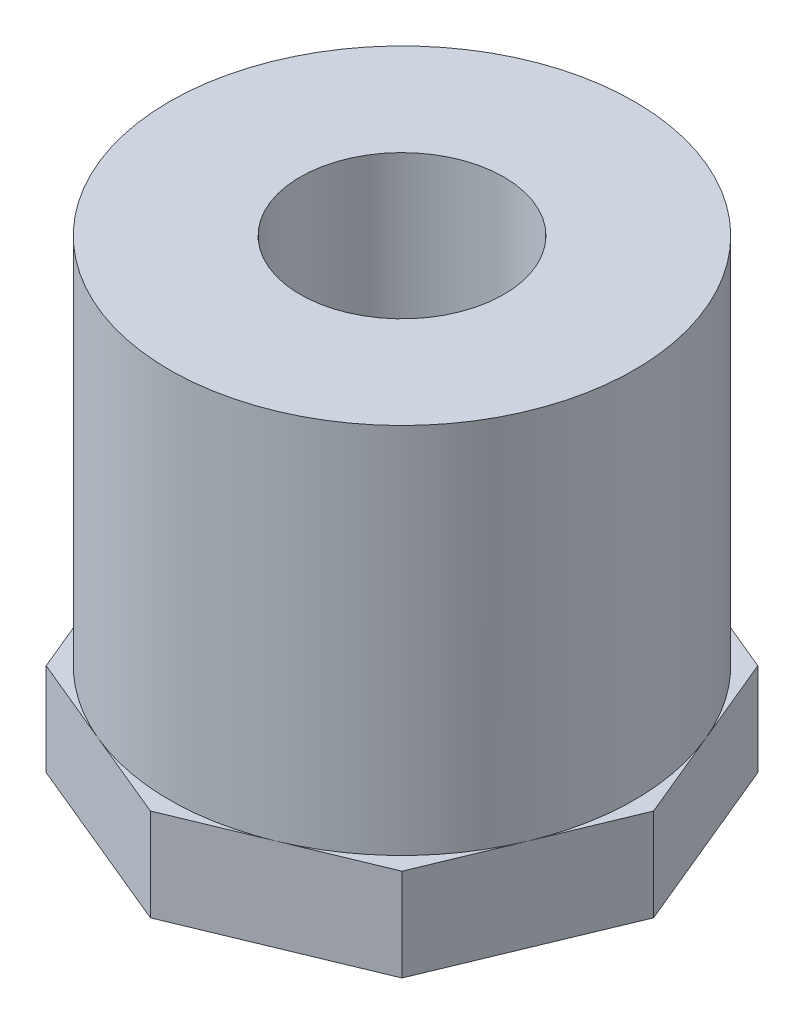
ISO-10303-21;
HEADER;
FILE_DESCRIPTION(('STEP AP214'),'2;1');
FILE_NAME('part.step','',(''),(''),'','','');
FILE_SCHEMA(('AUTOMOTIVE_DESIGN { 1 0 10303 214 1 1 1 1 }'));
ENDSEC;
DATA;
#1=APPLICATION_CONTEXT('core data for automotive mechanical design processes');
#2=APPLICATION_PROTOCOL_DEFINITION('international standard','automotive_design',2000,#1);
#3=PRODUCT_CONTEXT('',#1,'mechanical');
#4=PRODUCT('Part','Part','',(#3));
#5=PRODUCT_RELATED_PRODUCT_CATEGORY('part','',(#4));
#6=PRODUCT_DEFINITION_FORMATION('','',#4);
#7=PRODUCT_DEFINITION_CONTEXT('part definition',#1,'design');
#8=PRODUCT_DEFINITION('design','',#6,#7);
#9=PRODUCT_DEFINITION_SHAPE('','',#8);
#10=(LENGTH_UNIT() NAMED_UNIT(*) SI_UNIT(.MILLI.,.METRE.));
#11=(NAMED_UNIT(*) PLANE_ANGLE_UNIT() SI_UNIT($,.RADIAN.));
#12=(NAMED_UNIT(*) SI_UNIT($,.STERADIAN.) SOLID_ANGLE_UNIT());
#13=UNCERTAINTY_MEASURE_WITH_UNIT(LENGTH_MEASURE(1.E-05),#10,'distance_accuracy_value','');
#14=(GEOMETRIC_REPRESENTATION_CONTEXT(3) GLOBAL_UNCERTAINTY_ASSIGNED_CONTEXT((#13)) GLOBAL_UNIT_ASSIGNED_CONTEXT((#10,
#11,#12)) REPRESENTATION_CONTEXT('',''));
#15=CARTESIAN_POINT('',(0.,0.,0.));
#16=DIRECTION('',(0.,0.,1.));
#17=DIRECTION('',(1.,0.,0.));
#18=AXIS2_PLACEMENT_3D('',#15,#16,#17);
#19=CARTESIAN_POINT('',(0.,0.,0.));
#20=DIRECTION('',(0.,1.,0.));
#21=DIRECTION('',(-1.,0.,0.));
#22=AXIS2_PLACEMENT_3D('',#19,#20,#21);
#23=CYLINDRICAL_SURFACE('',#22,12.7);
#24=CARTESIAN_POINT('',(0.,25.4,0.));
#25=DIRECTION('',(0.,1.,0.));
#26=DIRECTION('',(-1.,0.,0.));
#27=AXIS2_PLACEMENT_3D('',#24,#25,#26);
#28=CIRCLE('',#27,12.7);
#29=CARTESIAN_POINT('',(-12.7,25.4,0.));
#30=VERTEX_POINT('',#29);
#31=EDGE_CURVE('E254',#30,#30,#28,.T.);
#32=ORIENTED_EDGE('',*,*,#31,.F.);
#33=EDGE_LOOP('',(#32));
#34=FACE_BOUND('',#33,.T.);
#35=CARTESIAN_POINT('',(0.,5.0546,0.));
#36=DIRECTION('',(0.,-1.,0.));
#37=DIRECTION('',(1.,0.,0.));
#38=AXIS2_PLACEMENT_3D('',#35,#36,#37);
#39=CIRCLE('',#38,12.7);
#40=CARTESIAN_POINT('',(11.7332700628933,5.0546,4.86007959103664));
#41=VERTEX_POINT('',#40);
#42=CARTESIAN_POINT('',(11.7332700628933,5.0546,-4.86007959103664));
#43=VERTEX_POINT('',#42);
#44=EDGE_CURVE('E53',#41,#43,#39,.F.);
#45=ORIENTED_EDGE('',*,*,#44,.T.);
#46=CARTESIAN_POINT('',(4.86007959103664,5.0546,-11.7332700628933));
#47=VERTEX_POINT('',#46);
#48=EDGE_CURVE('E11',#43,#47,#39,.F.);
#49=ORIENTED_EDGE('',*,*,#48,.T.);
#50=CARTESIAN_POINT('',(-4.86007959103663,5.0546,-11.7332700628933));
#51=VERTEX_POINT('',#50);
#52=EDGE_CURVE('E59',#47,#51,#39,.F.);
#53=ORIENTED_EDGE('',*,*,#52,.T.);
#54=CARTESIAN_POINT('',(-11.7332700628933,5.0546,-4.86007959103664));
#55=VERTEX_POINT('',#54);
#56=EDGE_CURVE('E293',#51,#55,#39,.F.);
#57=ORIENTED_EDGE('',*,*,#56,.T.);
#58=CARTESIAN_POINT('',(-11.7332700628933,5.0546,4.86007959103664));
#59=VERTEX_POINT('',#58);
#60=EDGE_CURVE('E290',#55,#59,#39,.F.);
#61=ORIENTED_EDGE('',*,*,#60,.T.);
#62=CARTESIAN_POINT('',(-4.86007959103664,5.0546,11.7332700628933));
#63=VERTEX_POINT('',#62);
#64=EDGE_CURVE('E287',#59,#63,#39,.F.);
#65=ORIENTED_EDGE('',*,*,#64,.T.);
#66=CARTESIAN_POINT('',(4.86007959103664,5.0546,11.7332700628933));
#67=VERTEX_POINT('',#66);
#68=EDGE_CURVE('E80',#63,#67,#39,.F.);
#69=ORIENTED_EDGE('',*,*,#68,.T.);
#70=EDGE_CURVE('E282',#67,#41,#39,.F.);
#71=ORIENTED_EDGE('',*,*,#70,.T.);
#72=EDGE_LOOP('',(#45,#49,#53,#57,#61,#65,#69,#71));
#73=FACE_BOUND('',#72,.T.);
#74=ADVANCED_FACE('F49',(#34,#73),#23,.T.);
#75=CARTESIAN_POINT('',(0.,25.4,0.));
#76=DIRECTION('',(0.,1.,0.));
#77=DIRECTION('',(-1.,0.,0.));
#78=AXIS2_PLACEMENT_3D('',#75,#76,#77);
#79=PLANE('',#78);
#80=CARTESIAN_POINT('',(0.,25.4,0.));
#81=DIRECTION('',(0.,-1.,0.));
#82=DIRECTION('',(0.,0.,-1.));
#83=AXIS2_PLACEMENT_3D('',#80,#81,#82);
#84=CIRCLE('',#83,5.5626);
#85=CARTESIAN_POINT('',(0.,25.4,-5.5626));
#86=VERTEX_POINT('',#85);
#87=EDGE_CURVE('E227',#86,#86,#84,.T.);
#88=ORIENTED_EDGE('',*,*,#87,.T.);
#89=EDGE_LOOP('',(#88));
#90=FACE_BOUND('',#89,.T.);
#91=ORIENTED_EDGE('',*,*,#31,.T.);
#92=EDGE_LOOP('',(#91));
#93=FACE_BOUND('',#92,.T.);
#94=ADVANCED_FACE('F343',(#90,#93),#79,.T.);
#95=CARTESIAN_POINT('',(9.72015918207329,5.0546,9.72015918207328));
#96=DIRECTION('',(0.382683432365089,0.,0.923879532511287));
#97=DIRECTION('',(0.923879532511287,0.,-0.38268343236509));
#98=AXIS2_PLACEMENT_3D('',#95,#96,#97);
#99=PLANE('',#98);
#100=DIRECTION('',(-0.923879532511287,0.,0.38268343236509));
#101=VECTOR('',#100,1.);
#102=CARTESIAN_POINT('',(9.72015918207329,0.,9.72015918207328));
#103=LINE('',#102,#101);
#104=CARTESIAN_POINT('',(9.72015918207329,0.,9.72015918207328));
#105=VERTEX_POINT('',#104);
#106=CARTESIAN_POINT('',(0.,0.,13.7463809437134));
#107=VERTEX_POINT('',#106);
#108=EDGE_CURVE('E224',#105,#107,#103,.T.);
#109=ORIENTED_EDGE('',*,*,#108,.F.);
#110=DIRECTION('',(0.,-1.,0.));
#111=VECTOR('',#110,1.);
#112=CARTESIAN_POINT('',(9.72015918207329,5.0546,9.72015918207328));
#113=LINE('',#112,#111);
#114=CARTESIAN_POINT('',(9.72015918207329,5.0546,9.72015918207328));
#115=VERTEX_POINT('',#114);
#116=EDGE_CURVE('E250',#115,#105,#113,.T.);
#117=ORIENTED_EDGE('',*,*,#116,.F.);
#118=DIRECTION('',(-0.923879532511287,0.,0.38268343236509));
#119=VECTOR('',#118,1.);
#120=CARTESIAN_POINT('',(9.72015918207329,5.0546,9.72015918207328));
#121=LINE('',#120,#119);
#122=EDGE_CURVE('E171',#115,#67,#121,.T.);
#123=ORIENTED_EDGE('',*,*,#122,.T.);
#124=CARTESIAN_POINT('',(0.,5.0546,13.7463809437134));
#125=VERTEX_POINT('',#124);
#126=EDGE_CURVE('E165',#67,#125,#121,.T.);
#127=ORIENTED_EDGE('',*,*,#126,.T.);
#128=DIRECTION('',(0.,-1.,0.));
#129=VECTOR('',#128,1.);
#130=CARTESIAN_POINT('',(0.,5.0546,13.7463809437134));
#131=LINE('',#130,#129);
#132=EDGE_CURVE('E168',#125,#107,#131,.T.);
#133=ORIENTED_EDGE('',*,*,#132,.T.);
#134=EDGE_LOOP('',(#109,#117,#123,#127,#133));
#135=FACE_BOUND('',#134,.T.);
#136=ADVANCED_FACE('F167',(#135),#99,.T.);
#137=CARTESIAN_POINT('',(13.7463809437134,5.0546,0.));
#138=DIRECTION('',(0.923879532511287,0.,0.38268343236509));
#139=DIRECTION('',(0.38268343236509,0.,-0.923879532511287));
#140=AXIS2_PLACEMENT_3D('',#137,#138,#139);
#141=PLANE('',#140);
#142=DIRECTION('',(-0.38268343236509,0.,0.923879532511287));
#143=VECTOR('',#142,1.);
#144=CARTESIAN_POINT('',(13.7463809437134,0.,0.));
#145=LINE('',#144,#143);
#146=CARTESIAN_POINT('',(13.7463809437134,0.,0.));
#147=VERTEX_POINT('',#146);
#148=EDGE_CURVE('E173',#147,#105,#145,.T.);
#149=ORIENTED_EDGE('',*,*,#148,.F.);
#150=DIRECTION('',(0.,-1.,0.));
#151=VECTOR('',#150,1.);
#152=CARTESIAN_POINT('',(13.7463809437134,5.0546,0.));
#153=LINE('',#152,#151);
#154=CARTESIAN_POINT('',(13.7463809437134,5.0546,0.));
#155=VERTEX_POINT('',#154);
#156=EDGE_CURVE('E255',#155,#147,#153,.T.);
#157=ORIENTED_EDGE('',*,*,#156,.F.);
#158=DIRECTION('',(-0.38268343236509,0.,0.923879532511287));
#159=VECTOR('',#158,1.);
#160=CARTESIAN_POINT('',(13.7463809437134,5.0546,0.));
#161=LINE('',#160,#159);
#162=EDGE_CURVE('E186',#155,#41,#161,.T.);
#163=ORIENTED_EDGE('',*,*,#162,.T.);
#164=EDGE_CURVE('E220',#41,#115,#161,.T.);
#165=ORIENTED_EDGE('',*,*,#164,.T.);
#166=ORIENTED_EDGE('',*,*,#116,.T.);
#167=EDGE_LOOP('',(#149,#157,#163,#165,#166));
#168=FACE_BOUND('',#167,.T.);
#169=ADVANCED_FACE('F353',(#168),#141,.T.);
#170=CARTESIAN_POINT('',(9.72015918207329,5.0546,-9.72015918207328));
#171=DIRECTION('',(0.923879532511287,0.,-0.38268343236509));
#172=DIRECTION('',(-0.38268343236509,0.,-0.923879532511287));
#173=AXIS2_PLACEMENT_3D('',#170,#171,#172);
#174=PLANE('',#173);
#175=ORIENTED_EDGE('',*,*,#156,.T.);
#176=DIRECTION('',(0.38268343236509,0.,0.923879532511287));
#177=VECTOR('',#176,1.);
#178=CARTESIAN_POINT('',(9.72015918207329,0.,-9.72015918207328));
#179=LINE('',#178,#177);
#180=CARTESIAN_POINT('',(9.72015918207329,0.,-9.72015918207328));
#181=VERTEX_POINT('',#180);
#182=EDGE_CURVE('E244',#181,#147,#179,.T.);
#183=ORIENTED_EDGE('',*,*,#182,.F.);
#184=DIRECTION('',(0.,-1.,0.));
#185=VECTOR('',#184,1.);
#186=CARTESIAN_POINT('',(9.72015918207329,5.0546,-9.72015918207328));
#187=LINE('',#186,#185);
#188=CARTESIAN_POINT('',(9.72015918207329,5.0546,-9.72015918207328));
#189=VERTEX_POINT('',#188);
#190=EDGE_CURVE('E259',#189,#181,#187,.T.);
#191=ORIENTED_EDGE('',*,*,#190,.F.);
#192=DIRECTION('',(0.38268343236509,0.,0.923879532511287));
#193=VECTOR('',#192,1.);
#194=CARTESIAN_POINT('',(9.72015918207329,5.0546,-9.72015918207328));
#195=LINE('',#194,#193);
#196=EDGE_CURVE('E69',#189,#43,#195,.T.);
#197=ORIENTED_EDGE('',*,*,#196,.T.);
#198=EDGE_CURVE('E217',#43,#155,#195,.T.);
#199=ORIENTED_EDGE('',*,*,#198,.T.);
#200=EDGE_LOOP('',(#175,#183,#191,#197,#199));
#201=FACE_BOUND('',#200,.T.);
#202=ADVANCED_FACE('F364',(#201),#174,.T.);
#203=CARTESIAN_POINT('',(0.,5.0546,-13.7463809437134));
#204=DIRECTION('',(0.38268343236509,0.,-0.923879532511287));
#205=DIRECTION('',(-0.923879532511287,0.,-0.38268343236509));
#206=AXIS2_PLACEMENT_3D('',#203,#204,#205);
#207=PLANE('',#206);
#208=DIRECTION('',(0.923879532511287,0.,0.38268343236509));
#209=VECTOR('',#208,1.);
#210=CARTESIAN_POINT('',(0.,0.,-13.7463809437134));
#211=LINE('',#210,#209);
#212=CARTESIAN_POINT('',(0.,0.,-13.7463809437134));
#213=VERTEX_POINT('',#212);
#214=EDGE_CURVE('E241',#213,#181,#211,.T.);
#215=ORIENTED_EDGE('',*,*,#214,.F.);
#216=DIRECTION('',(0.,-1.,0.));
#217=VECTOR('',#216,1.);
#218=CARTESIAN_POINT('',(0.,5.0546,-13.7463809437134));
#219=LINE('',#218,#217);
#220=CARTESIAN_POINT('',(0.,5.0546,-13.7463809437134));
#221=VERTEX_POINT('',#220);
#222=EDGE_CURVE('E263',#221,#213,#219,.T.);
#223=ORIENTED_EDGE('',*,*,#222,.F.);
#224=DIRECTION('',(0.923879532511287,0.,0.38268343236509));
#225=VECTOR('',#224,1.);
#226=CARTESIAN_POINT('',(0.,5.0546,-13.7463809437134));
#227=LINE('',#226,#225);
#228=EDGE_CURVE('E213',#221,#47,#227,.T.);
#229=ORIENTED_EDGE('',*,*,#228,.T.);
#230=EDGE_CURVE('E212',#47,#189,#227,.T.);
#231=ORIENTED_EDGE('',*,*,#230,.T.);
#232=ORIENTED_EDGE('',*,*,#190,.T.);
#233=EDGE_LOOP('',(#215,#223,#229,#231,#232));
#234=FACE_BOUND('',#233,.T.);
#235=ADVANCED_FACE('F310',(#234),#207,.T.);
#236=CARTESIAN_POINT('',(-9.72015918207328,5.0546,-9.72015918207329));
#237=DIRECTION('',(-0.382683432365089,0.,-0.923879532511287));
#238=DIRECTION('',(-0.923879532511287,0.,0.382683432365089));
#239=AXIS2_PLACEMENT_3D('',#236,#237,#238);
#240=PLANE('',#239);
#241=DIRECTION('',(0.923879532511287,0.,-0.382683432365089));
#242=VECTOR('',#241,1.);
#243=CARTESIAN_POINT('',(-9.72015918207328,0.,-9.72015918207329));
#244=LINE('',#243,#242);
#245=CARTESIAN_POINT('',(-9.72015918207328,0.,-9.72015918207329));
#246=VERTEX_POINT('',#245);
#247=EDGE_CURVE('E237',#246,#213,#244,.T.);
#248=ORIENTED_EDGE('',*,*,#247,.F.);
#249=DIRECTION('',(0.,-1.,0.));
#250=VECTOR('',#249,1.);
#251=CARTESIAN_POINT('',(-9.72015918207328,5.0546,-9.72015918207329));
#252=LINE('',#251,#250);
#253=CARTESIAN_POINT('',(-9.72015918207328,5.0546,-9.72015918207329));
#254=VERTEX_POINT('',#253);
#255=EDGE_CURVE('E267',#254,#246,#252,.T.);
#256=ORIENTED_EDGE('',*,*,#255,.F.);
#257=DIRECTION('',(0.923879532511287,0.,-0.382683432365089));
#258=VECTOR('',#257,1.);
#259=CARTESIAN_POINT('',(-9.72015918207328,5.0546,-9.72015918207329));
#260=LINE('',#259,#258);
#261=EDGE_CURVE('E208',#254,#51,#260,.T.);
#262=ORIENTED_EDGE('',*,*,#261,.T.);
#263=EDGE_CURVE('E207',#51,#221,#260,.T.);
#264=ORIENTED_EDGE('',*,*,#263,.T.);
#265=ORIENTED_EDGE('',*,*,#222,.T.);
#266=EDGE_LOOP('',(#248,#256,#262,#264,#265));
#267=FACE_BOUND('',#266,.T.);
#268=ADVANCED_FACE('F312',(#267),#240,.T.);
#269=CARTESIAN_POINT('',(-13.7463809437134,5.0546,0.));
#270=DIRECTION('',(-0.923879532511287,0.,-0.38268343236509));
#271=DIRECTION('',(-0.38268343236509,0.,0.923879532511287));
#272=AXIS2_PLACEMENT_3D('',#269,#270,#271);
#273=PLANE('',#272);
#274=DIRECTION('',(0.38268343236509,0.,-0.923879532511287));
#275=VECTOR('',#274,1.);
#276=CARTESIAN_POINT('',(-13.7463809437134,0.,0.));
#277=LINE('',#276,#275);
#278=CARTESIAN_POINT('',(-13.7463809437134,0.,0.));
#279=VERTEX_POINT('',#278);
#280=EDGE_CURVE('E233',#279,#246,#277,.T.);
#281=ORIENTED_EDGE('',*,*,#280,.F.);
#282=DIRECTION('',(0.,-1.,0.));
#283=VECTOR('',#282,1.);
#284=CARTESIAN_POINT('',(-13.7463809437134,5.0546,0.));
#285=LINE('',#284,#283);
#286=CARTESIAN_POINT('',(-13.7463809437134,5.0546,0.));
#287=VERTEX_POINT('',#286);
#288=EDGE_CURVE('E271',#287,#279,#285,.T.);
#289=ORIENTED_EDGE('',*,*,#288,.F.);
#290=DIRECTION('',(0.38268343236509,0.,-0.923879532511287));
#291=VECTOR('',#290,1.);
#292=CARTESIAN_POINT('',(-13.7463809437134,5.0546,0.));
#293=LINE('',#292,#291);
#294=EDGE_CURVE('E203',#287,#55,#293,.T.);
#295=ORIENTED_EDGE('',*,*,#294,.T.);
#296=EDGE_CURVE('E202',#55,#254,#293,.T.);
#297=ORIENTED_EDGE('',*,*,#296,.T.);
#298=ORIENTED_EDGE('',*,*,#255,.T.);
#299=EDGE_LOOP('',(#281,#289,#295,#297,#298));
#300=FACE_BOUND('',#299,.T.);
#301=ADVANCED_FACE('F322',(#300),#273,.T.);
#302=CARTESIAN_POINT('',(-9.72015918207329,5.0546,9.72015918207328));
#303=DIRECTION('',(-0.923879532511287,0.,0.382683432365089));
#304=DIRECTION('',(0.38268343236509,0.,0.923879532511287));
#305=AXIS2_PLACEMENT_3D('',#302,#303,#304);
#306=PLANE('',#305);
#307=DIRECTION('',(-0.38268343236509,0.,-0.923879532511287));
#308=VECTOR('',#307,1.);
#309=CARTESIAN_POINT('',(-9.72015918207329,0.,9.72015918207328));
#310=LINE('',#309,#308);
#311=CARTESIAN_POINT('',(-9.72015918207329,0.,9.72015918207328));
#312=VERTEX_POINT('',#311);
#313=EDGE_CURVE('E229',#312,#279,#310,.T.);
#314=ORIENTED_EDGE('',*,*,#313,.F.);
#315=DIRECTION('',(0.,-1.,0.));
#316=VECTOR('',#315,1.);
#317=CARTESIAN_POINT('',(-9.72015918207329,5.0546,9.72015918207328));
#318=LINE('',#317,#316);
#319=CARTESIAN_POINT('',(-9.72015918207329,5.0546,9.72015918207328));
#320=VERTEX_POINT('',#319);
#321=EDGE_CURVE('E185',#320,#312,#318,.T.);
#322=ORIENTED_EDGE('',*,*,#321,.F.);
#323=DIRECTION('',(-0.38268343236509,0.,-0.923879532511287));
#324=VECTOR('',#323,1.);
#325=CARTESIAN_POINT('',(-9.72015918207329,5.0546,9.72015918207328));
#326=LINE('',#325,#324);
#327=EDGE_CURVE('E195',#320,#59,#326,.T.);
#328=ORIENTED_EDGE('',*,*,#327,.T.);
#329=EDGE_CURVE('E190',#59,#287,#326,.T.);
#330=ORIENTED_EDGE('',*,*,#329,.T.);
#331=ORIENTED_EDGE('',*,*,#288,.T.);
#332=EDGE_LOOP('',(#314,#322,#328,#330,#331));
#333=FACE_BOUND('',#332,.T.);
#334=ADVANCED_FACE('F329',(#333),#306,.T.);
#335=CARTESIAN_POINT('',(0.,5.0546,13.7463809437134));
#336=DIRECTION('',(-0.38268343236509,0.,0.923879532511287));
#337=DIRECTION('',(0.923879532511287,0.,0.38268343236509));
#338=AXIS2_PLACEMENT_3D('',#335,#336,#337);
#339=PLANE('',#338);
#340=DIRECTION('',(-0.923879532511287,0.,-0.38268343236509));
#341=VECTOR('',#340,1.);
#342=CARTESIAN_POINT('',(0.,0.,13.7463809437134));
#343=LINE('',#342,#341);
#344=EDGE_CURVE('E182',#107,#312,#343,.T.);
#345=ORIENTED_EDGE('',*,*,#344,.F.);
#346=ORIENTED_EDGE('',*,*,#132,.F.);
#347=DIRECTION('',(-0.923879532511287,0.,-0.38268343236509));
#348=VECTOR('',#347,1.);
#349=CARTESIAN_POINT('',(0.,5.0546,13.7463809437134));
#350=LINE('',#349,#348);
#351=EDGE_CURVE('E178',#125,#63,#350,.T.);
#352=ORIENTED_EDGE('',*,*,#351,.T.);
#353=EDGE_CURVE('E191',#63,#320,#350,.T.);
#354=ORIENTED_EDGE('',*,*,#353,.T.);
#355=ORIENTED_EDGE('',*,*,#321,.T.);
#356=EDGE_LOOP('',(#345,#346,#352,#354,#355));
#357=FACE_BOUND('',#356,.T.);
#358=ADVANCED_FACE('F177',(#357),#339,.T.);
#359=CARTESIAN_POINT('',(0.,5.0546,0.));
#360=DIRECTION('',(0.,-1.,0.));
#361=DIRECTION('',(1.,0.,0.));
#362=AXIS2_PLACEMENT_3D('',#359,#360,#361);
#363=PLANE('',#362);
#364=ORIENTED_EDGE('',*,*,#48,.F.);
#365=ORIENTED_EDGE('',*,*,#196,.F.);
#366=ORIENTED_EDGE('',*,*,#230,.F.);
#367=EDGE_LOOP('',(#364,#365,#366));
#368=FACE_BOUND('',#367,.T.);
#369=ADVANCED_FACE('F306',(#368),#363,.F.);
#370=ORIENTED_EDGE('',*,*,#52,.F.);
#371=ORIENTED_EDGE('',*,*,#228,.F.);
#372=ORIENTED_EDGE('',*,*,#263,.F.);
#373=EDGE_LOOP('',(#370,#371,#372));
#374=FACE_BOUND('',#373,.T.);
#375=ADVANCED_FACE('F304',(#374),#363,.F.);
#376=ORIENTED_EDGE('',*,*,#56,.F.);
#377=ORIENTED_EDGE('',*,*,#261,.F.);
#378=ORIENTED_EDGE('',*,*,#296,.F.);
#379=EDGE_LOOP('',(#376,#377,#378));
#380=FACE_BOUND('',#379,.T.);
#381=ADVANCED_FACE('F318',(#380),#363,.F.);
#382=ORIENTED_EDGE('',*,*,#60,.F.);
#383=ORIENTED_EDGE('',*,*,#294,.F.);
#384=ORIENTED_EDGE('',*,*,#329,.F.);
#385=EDGE_LOOP('',(#382,#383,#384));
#386=FACE_BOUND('',#385,.T.);
#387=ADVANCED_FACE('F325',(#386),#363,.F.);
#388=ORIENTED_EDGE('',*,*,#64,.F.);
#389=ORIENTED_EDGE('',*,*,#327,.F.);
#390=ORIENTED_EDGE('',*,*,#353,.F.);
#391=EDGE_LOOP('',(#388,#389,#390));
#392=FACE_BOUND('',#391,.T.);
#393=ADVANCED_FACE('F331',(#392),#363,.F.);
#394=ORIENTED_EDGE('',*,*,#68,.F.);
#395=ORIENTED_EDGE('',*,*,#351,.F.);
#396=ORIENTED_EDGE('',*,*,#126,.F.);
#397=EDGE_LOOP('',(#394,#395,#396));
#398=FACE_BOUND('',#397,.T.);
#399=ADVANCED_FACE('F188',(#398),#363,.F.);
#400=ORIENTED_EDGE('',*,*,#70,.F.);
#401=ORIENTED_EDGE('',*,*,#122,.F.);
#402=ORIENTED_EDGE('',*,*,#164,.F.);
#403=EDGE_LOOP('',(#400,#401,#402));
#404=FACE_BOUND('',#403,.T.);
#405=ADVANCED_FACE('F338',(#404),#363,.F.);
#406=ORIENTED_EDGE('',*,*,#44,.F.);
#407=ORIENTED_EDGE('',*,*,#162,.F.);
#408=ORIENTED_EDGE('',*,*,#198,.F.);
#409=EDGE_LOOP('',(#406,#407,#408));
#410=FACE_BOUND('',#409,.T.);
#411=ADVANCED_FACE('F339',(#410),#363,.F.);
#412=CARTESIAN_POINT('',(-12.7,0.,0.));
#413=DIRECTION('',(0.,-1.,0.));
#414=DIRECTION('',(1.,0.,0.));
#415=AXIS2_PLACEMENT_3D('',#412,#413,#414);
#416=PLANE('',#415);
#417=CARTESIAN_POINT('',(0.,0.,0.));
#418=DIRECTION('',(0.,-1.,0.));
#419=DIRECTION('',(0.,0.,-1.));
#420=AXIS2_PLACEMENT_3D('',#417,#418,#419);
#421=CIRCLE('',#420,6.243701);
#422=CARTESIAN_POINT('',(0.,0.,-6.243701));
#423=VERTEX_POINT('',#422);
#424=EDGE_CURVE('E383',#423,#423,#421,.T.);
#425=ORIENTED_EDGE('',*,*,#424,.F.);
#426=EDGE_LOOP('',(#425));
#427=FACE_BOUND('',#426,.T.);
#428=ORIENTED_EDGE('',*,*,#108,.T.);
#429=ORIENTED_EDGE('',*,*,#344,.T.);
#430=ORIENTED_EDGE('',*,*,#313,.T.);
#431=ORIENTED_EDGE('',*,*,#280,.T.);
#432=ORIENTED_EDGE('',*,*,#247,.T.);
#433=ORIENTED_EDGE('',*,*,#214,.T.);
#434=ORIENTED_EDGE('',*,*,#182,.T.);
#435=ORIENTED_EDGE('',*,*,#148,.T.);
#436=EDGE_LOOP('',(#428,#429,#430,#431,#432,#433,#434,#435));
#437=FACE_BOUND('',#436,.T.);
#438=ADVANCED_FACE('F51',(#427,#437),#416,.T.);
#439=CARTESIAN_POINT('',(0.,0.,0.));
#440=DIRECTION('',(0.,-1.,0.));
#441=DIRECTION('',(0.,0.,-1.));
#442=AXIS2_PLACEMENT_3D('',#439,#440,#441);
#443=CYLINDRICAL_SURFACE('',#442,5.5626);
#444=ORIENTED_EDGE('',*,*,#87,.F.);
#445=EDGE_LOOP('',(#444));
#446=FACE_BOUND('',#445,.T.);
#447=CARTESIAN_POINT('',(0.,10.0203,0.));
#448=DIRECTION('',(0.,-1.,0.));
#449=DIRECTION('',(0.,0.,-1.));
#450=AXIS2_PLACEMENT_3D('',#447,#448,#449);
#451=CIRCLE('',#450,5.5626);
#452=CARTESIAN_POINT('',(0.,10.0203,-5.5626));
#453=VERTEX_POINT('',#452);
#454=EDGE_CURVE('E377',#453,#453,#451,.T.);
#455=ORIENTED_EDGE('',*,*,#454,.T.);
#456=EDGE_LOOP('',(#455));
#457=FACE_BOUND('',#456,.T.);
#458=ADVANCED_FACE('F392',(#446,#457),#443,.F.);
#459=CARTESIAN_POINT('',(5.5626,10.0203,0.));
#460=DIRECTION('',(0.,1.,0.));
#461=DIRECTION('',(0.,0.,1.));
#462=AXIS2_PLACEMENT_3D('',#459,#460,#461);
#463=PLANE('',#462);
#464=ORIENTED_EDGE('',*,*,#454,.F.);
#465=EDGE_LOOP('',(#464));
#466=FACE_BOUND('',#465,.T.);
#467=CARTESIAN_POINT('',(0.,10.0203,0.));
#468=DIRECTION('',(0.,-1.,0.));
#469=DIRECTION('',(0.,0.,-1.));
#470=AXIS2_PLACEMENT_3D('',#467,#468,#469);
#471=CIRCLE('',#470,5.94367979910952);
#472=CARTESIAN_POINT('',(0.,10.0203,-5.94367979910952));
#473=VERTEX_POINT('',#472);
#474=EDGE_CURVE('E380',#473,#473,#471,.T.);
#475=ORIENTED_EDGE('',*,*,#474,.T.);
#476=EDGE_LOOP('',(#475));
#477=FACE_BOUND('',#476,.T.);
#478=ADVANCED_FACE('F395',(#466,#477),#463,.F.);
#479=CARTESIAN_POINT('',(0.,0.,0.));
#480=DIRECTION('',(0.,-1.,0.));
#481=DIRECTION('',(0.,0.,-1.));
#482=AXIS2_PLACEMENT_3D('',#479,#480,#481);
#483=CONICAL_SURFACE('',#482,6.243701,0.0299323966717029);
#484=ORIENTED_EDGE('',*,*,#474,.F.);
#485=EDGE_LOOP('',(#484));
#486=FACE_BOUND('',#485,.T.);
#487=ORIENTED_EDGE('',*,*,#424,.T.);
#488=EDGE_LOOP('',(#487));
#489=FACE_BOUND('',#488,.T.);
#490=ADVANCED_FACE('F399',(#486,#489),#483,.F.);
#491=CLOSED_SHELL('',(#74,#94,#136,#169,#202,#235,#268,#301,#334,#358,#369,#375,#381,#387,#393,
#399,#405,#411,#438,#458,#478,#490));
#492=MANIFOLD_SOLID_BREP('B2',#491);
#493=ADVANCED_BREP_SHAPE_REPRESENTATION('',(#18,#492),#14);
#494=SHAPE_DEFINITION_REPRESENTATION(#9,#493);
ENDSEC;
END-ISO-10303-21;
